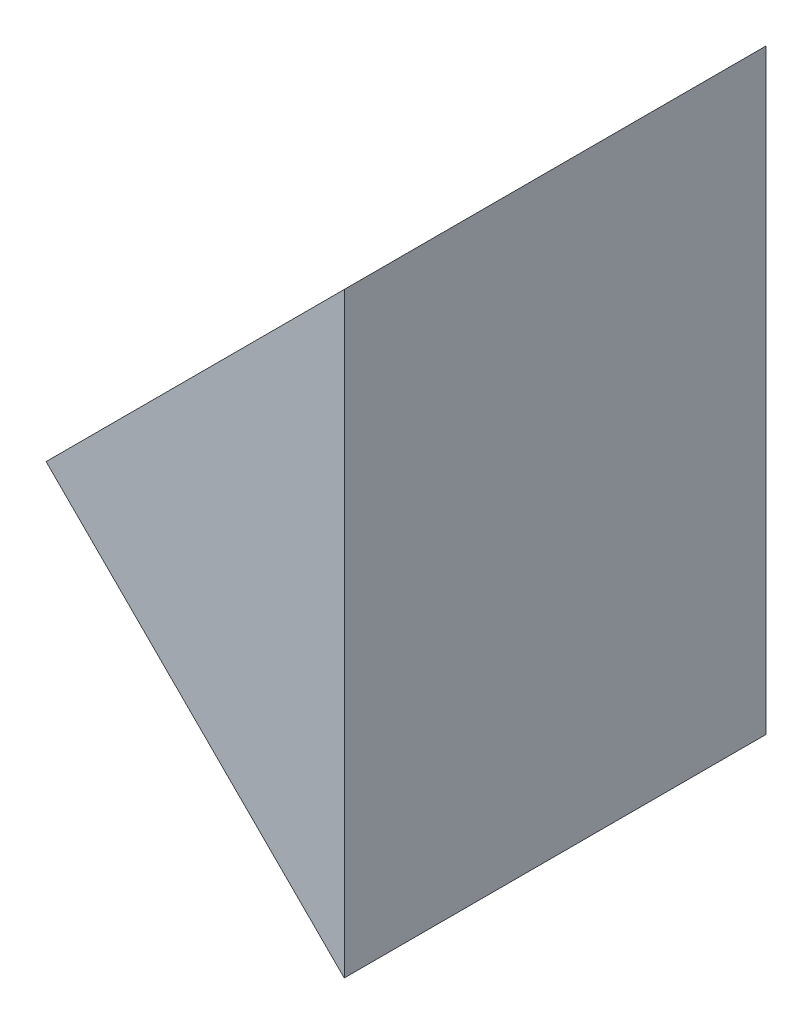
ISO-10303-21;
HEADER;
FILE_DESCRIPTION(('STEP AP214'),'2;1');
FILE_NAME('part.step','',(''),(''),'','','');
FILE_SCHEMA(('AUTOMOTIVE_DESIGN { 1 0 10303 214 1 1 1 1 }'));
ENDSEC;
DATA;
#1=APPLICATION_CONTEXT('core data for automotive mechanical design processes');
#2=APPLICATION_PROTOCOL_DEFINITION('international standard','automotive_design',2000,#1);
#3=PRODUCT_CONTEXT('',#1,'mechanical');
#4=PRODUCT('Part','Part','',(#3));
#5=PRODUCT_RELATED_PRODUCT_CATEGORY('part','',(#4));
#6=PRODUCT_DEFINITION_FORMATION('','',#4);
#7=PRODUCT_DEFINITION_CONTEXT('part definition',#1,'design');
#8=PRODUCT_DEFINITION('design','',#6,#7);
#9=PRODUCT_DEFINITION_SHAPE('','',#8);
#10=(LENGTH_UNIT() NAMED_UNIT(*) SI_UNIT(.MILLI.,.METRE.));
#11=(NAMED_UNIT(*) PLANE_ANGLE_UNIT() SI_UNIT($,.RADIAN.));
#12=(NAMED_UNIT(*) SI_UNIT($,.STERADIAN.) SOLID_ANGLE_UNIT());
#13=UNCERTAINTY_MEASURE_WITH_UNIT(LENGTH_MEASURE(1.E-05),#10,'distance_accuracy_value','');
#14=(GEOMETRIC_REPRESENTATION_CONTEXT(3) GLOBAL_UNCERTAINTY_ASSIGNED_CONTEXT((#13)) GLOBAL_UNIT_ASSIGNED_CONTEXT((#10,
#11,#12)) REPRESENTATION_CONTEXT('',''));
#15=CARTESIAN_POINT('',(0.,0.,0.));
#16=DIRECTION('',(0.,0.,1.));
#17=DIRECTION('',(1.,0.,0.));
#18=AXIS2_PLACEMENT_3D('',#15,#16,#17);
#19=CARTESIAN_POINT('',(147.530509646319,23.8326295369476,15.));
#20=DIRECTION('',(-1.,0.,0.));
#21=DIRECTION('',(0.,0.,1.));
#22=AXIS2_PLACEMENT_3D('',#19,#20,#21);
#23=PLANE('',#22);
#24=DIRECTION('',(0.,1.,0.));
#25=VECTOR('',#24,1.);
#26=CARTESIAN_POINT('',(147.530509646319,23.8326295369476,0.));
#27=LINE('',#26,#25);
#28=CARTESIAN_POINT('',(147.530509646319,23.8326295369476,0.));
#29=VERTEX_POINT('',#28);
#30=CARTESIAN_POINT('',(147.530509646319,45.045832972544,0.));
#31=VERTEX_POINT('',#30);
#32=EDGE_CURVE('E84',#29,#31,#27,.T.);
#33=ORIENTED_EDGE('',*,*,#32,.T.);
#34=DIRECTION('',(0.,0.,-1.));
#35=VECTOR('',#34,1.);
#36=CARTESIAN_POINT('',(147.530509646319,45.045832972544,15.));
#37=LINE('',#36,#35);
#38=CARTESIAN_POINT('',(147.530509646319,45.045832972544,15.));
#39=VERTEX_POINT('',#38);
#40=EDGE_CURVE('E11',#39,#31,#37,.T.);
#41=ORIENTED_EDGE('',*,*,#40,.F.);
#42=DIRECTION('',(0.,1.,0.));
#43=VECTOR('',#42,1.);
#44=CARTESIAN_POINT('',(147.530509646319,23.8326295369476,15.));
#45=LINE('',#44,#43);
#46=CARTESIAN_POINT('',(147.530509646319,23.8326295369476,15.));
#47=VERTEX_POINT('',#46);
#48=EDGE_CURVE('E77',#47,#39,#45,.T.);
#49=ORIENTED_EDGE('',*,*,#48,.F.);
#50=DIRECTION('',(0.,0.,-1.));
#51=VECTOR('',#50,1.);
#52=CARTESIAN_POINT('',(147.530509646319,23.8326295369476,15.));
#53=LINE('',#52,#51);
#54=EDGE_CURVE('E85',#47,#29,#53,.T.);
#55=ORIENTED_EDGE('',*,*,#54,.T.);
#56=EDGE_LOOP('',(#33,#41,#49,#55));
#57=FACE_BOUND('',#56,.T.);
#58=ADVANCED_FACE('F37',(#57),#23,.F.);
#59=CARTESIAN_POINT('',(147.530509646319,45.045832972544,15.));
#60=DIRECTION('',(0.707106781186547,-0.707106781186549,0.));
#61=DIRECTION('',(0.707106781186549,0.707106781186547,0.));
#62=AXIS2_PLACEMENT_3D('',#59,#60,#61);
#63=PLANE('',#62);
#64=DIRECTION('',(-0.707106781186548,-0.707106781186547,0.));
#65=VECTOR('',#64,1.);
#66=CARTESIAN_POINT('',(147.530509646319,45.045832972544,0.));
#67=LINE('',#66,#65);
#68=CARTESIAN_POINT('',(136.923907928521,34.4392312547458,0.));
#69=VERTEX_POINT('',#68);
#70=EDGE_CURVE('E65',#31,#69,#67,.T.);
#71=ORIENTED_EDGE('',*,*,#70,.T.);
#72=DIRECTION('',(0.,0.,-1.));
#73=VECTOR('',#72,1.);
#74=CARTESIAN_POINT('',(136.923907928521,34.4392312547458,15.));
#75=LINE('',#74,#73);
#76=CARTESIAN_POINT('',(136.923907928521,34.4392312547458,15.));
#77=VERTEX_POINT('',#76);
#78=EDGE_CURVE('E45',#77,#69,#75,.T.);
#79=ORIENTED_EDGE('',*,*,#78,.F.);
#80=DIRECTION('',(-0.707106781186548,-0.707106781186547,0.));
#81=VECTOR('',#80,1.);
#82=CARTESIAN_POINT('',(147.530509646319,45.045832972544,15.));
#83=LINE('',#82,#81);
#84=EDGE_CURVE('E73',#39,#77,#83,.T.);
#85=ORIENTED_EDGE('',*,*,#84,.F.);
#86=ORIENTED_EDGE('',*,*,#40,.T.);
#87=EDGE_LOOP('',(#71,#79,#85,#86));
#88=FACE_BOUND('',#87,.T.);
#89=ADVANCED_FACE('F74',(#88),#63,.F.);
#90=CARTESIAN_POINT('',(136.923907928521,34.4392312547458,15.));
#91=DIRECTION('',(0.707106781186547,0.707106781186548,0.));
#92=DIRECTION('',(-0.707106781186548,0.707106781186547,0.));
#93=AXIS2_PLACEMENT_3D('',#90,#91,#92);
#94=PLANE('',#93);
#95=DIRECTION('',(0.707106781186548,-0.707106781186547,0.));
#96=VECTOR('',#95,1.);
#97=CARTESIAN_POINT('',(136.923907928521,34.4392312547458,0.));
#98=LINE('',#97,#96);
#99=EDGE_CURVE('E70',#69,#29,#98,.T.);
#100=ORIENTED_EDGE('',*,*,#99,.T.);
#101=ORIENTED_EDGE('',*,*,#54,.F.);
#102=DIRECTION('',(0.707106781186548,-0.707106781186547,0.));
#103=VECTOR('',#102,1.);
#104=CARTESIAN_POINT('',(136.923907928521,34.4392312547458,15.));
#105=LINE('',#104,#103);
#106=EDGE_CURVE('E53',#77,#47,#105,.T.);
#107=ORIENTED_EDGE('',*,*,#106,.F.);
#108=ORIENTED_EDGE('',*,*,#78,.T.);
#109=EDGE_LOOP('',(#100,#101,#107,#108));
#110=FACE_BOUND('',#109,.T.);
#111=ADVANCED_FACE('F92',(#110),#94,.F.);
#112=CARTESIAN_POINT('',(0.,0.,15.));
#113=DIRECTION('',(0.,0.,1.));
#114=DIRECTION('',(1.,0.,0.));
#115=AXIS2_PLACEMENT_3D('',#112,#113,#114);
#116=PLANE('',#115);
#117=ORIENTED_EDGE('',*,*,#48,.T.);
#118=ORIENTED_EDGE('',*,*,#84,.T.);
#119=ORIENTED_EDGE('',*,*,#106,.T.);
#120=EDGE_LOOP('',(#117,#118,#119));
#121=FACE_BOUND('',#120,.T.);
#122=ADVANCED_FACE('F80',(#121),#116,.T.);
#123=CARTESIAN_POINT('',(0.,0.,0.));
#124=DIRECTION('',(0.,0.,1.));
#125=DIRECTION('',(1.,0.,0.));
#126=AXIS2_PLACEMENT_3D('',#123,#124,#125);
#127=PLANE('',#126);
#128=ORIENTED_EDGE('',*,*,#32,.F.);
#129=ORIENTED_EDGE('',*,*,#99,.F.);
#130=ORIENTED_EDGE('',*,*,#70,.F.);
#131=EDGE_LOOP('',(#128,#129,#130));
#132=FACE_BOUND('',#131,.T.);
#133=ADVANCED_FACE('F93',(#132),#127,.F.);
#134=CLOSED_SHELL('',(#58,#89,#111,#122,#133));
#135=MANIFOLD_SOLID_BREP('B2',#134);
#136=ADVANCED_BREP_SHAPE_REPRESENTATION('',(#18,#135),#14);
#137=SHAPE_DEFINITION_REPRESENTATION(#9,#136);
ENDSEC;
END-ISO-10303-21;
